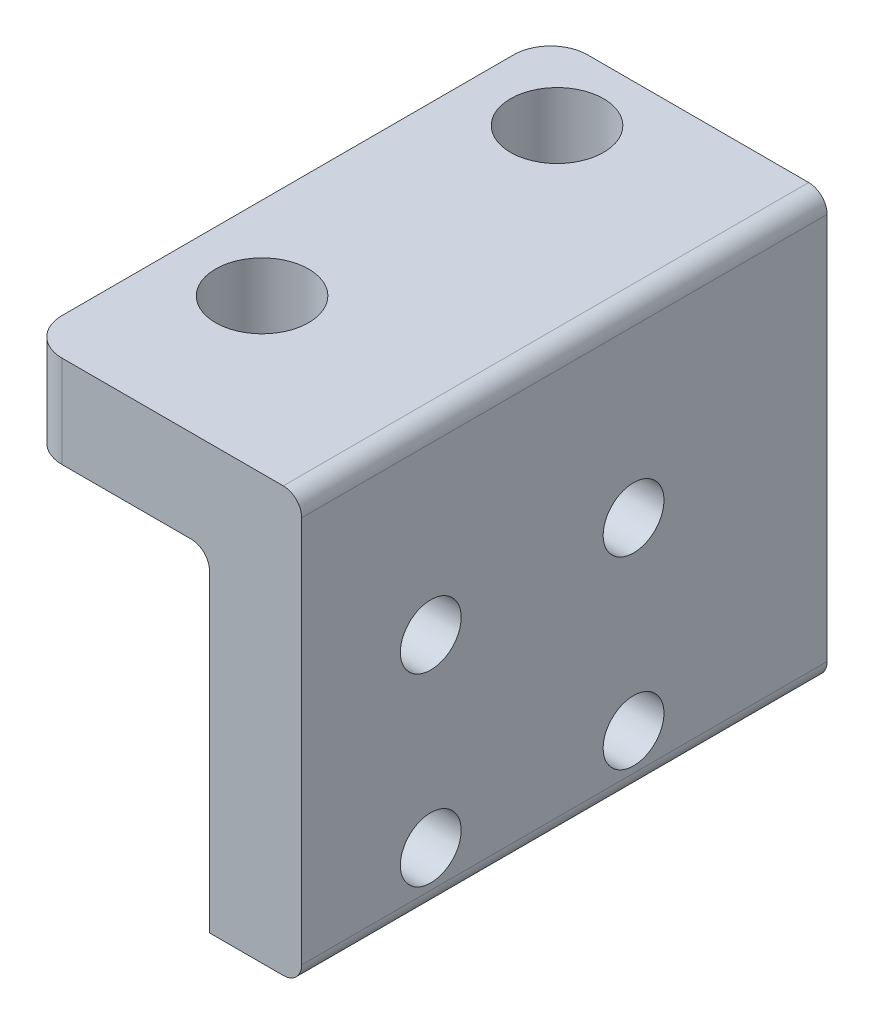
ISO-10303-21;
HEADER;
FILE_DESCRIPTION(('STEP AP214'),'2;1');
FILE_NAME('part.step','',(''),(''),'','','');
FILE_SCHEMA(('AUTOMOTIVE_DESIGN { 1 0 10303 214 1 1 1 1 }'));
ENDSEC;
DATA;
#1=APPLICATION_CONTEXT('core data for automotive mechanical design processes');
#2=APPLICATION_PROTOCOL_DEFINITION('international standard','automotive_design',2000,#1);
#3=PRODUCT_CONTEXT('',#1,'mechanical');
#4=PRODUCT('Part','Part','',(#3));
#5=PRODUCT_RELATED_PRODUCT_CATEGORY('part','',(#4));
#6=PRODUCT_DEFINITION_FORMATION('','',#4);
#7=PRODUCT_DEFINITION_CONTEXT('part definition',#1,'design');
#8=PRODUCT_DEFINITION('design','',#6,#7);
#9=PRODUCT_DEFINITION_SHAPE('','',#8);
#10=(LENGTH_UNIT() NAMED_UNIT(*) SI_UNIT(.MILLI.,.METRE.));
#11=(NAMED_UNIT(*) PLANE_ANGLE_UNIT() SI_UNIT($,.RADIAN.));
#12=(NAMED_UNIT(*) SI_UNIT($,.STERADIAN.) SOLID_ANGLE_UNIT());
#13=UNCERTAINTY_MEASURE_WITH_UNIT(LENGTH_MEASURE(1.E-05),#10,'distance_accuracy_value','');
#14=(GEOMETRIC_REPRESENTATION_CONTEXT(3) GLOBAL_UNCERTAINTY_ASSIGNED_CONTEXT((#13)) GLOBAL_UNIT_ASSIGNED_CONTEXT((#10,
#11,#12)) REPRESENTATION_CONTEXT('',''));
#15=CARTESIAN_POINT('',(0.,0.,0.));
#16=DIRECTION('',(0.,0.,1.));
#17=DIRECTION('',(1.,0.,0.));
#18=AXIS2_PLACEMENT_3D('',#15,#16,#17);
#19=CARTESIAN_POINT('',(0.,-18.,28.5));
#20=DIRECTION('',(1.,0.,0.));
#21=DIRECTION('',(0.,1.,0.));
#22=AXIS2_PLACEMENT_3D('',#19,#20,#21);
#23=PLANE('',#22);
#24=CARTESIAN_POINT('',(0.,-5.,10.5));
#25=DIRECTION('',(-1.,0.,0.));
#26=DIRECTION('',(0.,0.,1.));
#27=AXIS2_PLACEMENT_3D('',#24,#25,#26);
#28=CIRCLE('',#27,1.65);
#29=CARTESIAN_POINT('',(0.,-5.,12.15));
#30=VERTEX_POINT('',#29);
#31=EDGE_CURVE('E295',#30,#30,#28,.T.);
#32=ORIENTED_EDGE('',*,*,#31,.F.);
#33=EDGE_LOOP('',(#32));
#34=FACE_BOUND('',#33,.T.);
#35=CARTESIAN_POINT('',(0.,-15.,10.5));
#36=DIRECTION('',(-1.,0.,0.));
#37=DIRECTION('',(0.,0.,1.));
#38=AXIS2_PLACEMENT_3D('',#35,#36,#37);
#39=CIRCLE('',#38,1.65);
#40=CARTESIAN_POINT('',(0.,-15.,12.15));
#41=VERTEX_POINT('',#40);
#42=EDGE_CURVE('E289',#41,#41,#39,.T.);
#43=ORIENTED_EDGE('',*,*,#42,.F.);
#44=EDGE_LOOP('',(#43));
#45=FACE_BOUND('',#44,.T.);
#46=CARTESIAN_POINT('',(0.,-15.,21.5));
#47=DIRECTION('',(-1.,0.,0.));
#48=DIRECTION('',(0.,0.,1.));
#49=AXIS2_PLACEMENT_3D('',#46,#47,#48);
#50=CIRCLE('',#49,1.65);
#51=CARTESIAN_POINT('',(0.,-15.,23.15));
#52=VERTEX_POINT('',#51);
#53=EDGE_CURVE('E283',#52,#52,#50,.T.);
#54=ORIENTED_EDGE('',*,*,#53,.F.);
#55=EDGE_LOOP('',(#54));
#56=FACE_BOUND('',#55,.T.);
#57=CARTESIAN_POINT('',(0.,-5.,21.5));
#58=DIRECTION('',(-1.,0.,0.));
#59=DIRECTION('',(0.,0.,1.));
#60=AXIS2_PLACEMENT_3D('',#57,#58,#59);
#61=CIRCLE('',#60,1.65);
#62=CARTESIAN_POINT('',(0.,-5.,23.15));
#63=VERTEX_POINT('',#62);
#64=EDGE_CURVE('E277',#63,#63,#61,.T.);
#65=ORIENTED_EDGE('',*,*,#64,.F.);
#66=EDGE_LOOP('',(#65));
#67=FACE_BOUND('',#66,.T.);
#68=DIRECTION('',(0.,-1.,0.));
#69=VECTOR('',#68,1.);
#70=CARTESIAN_POINT('',(0.,-18.,28.5));
#71=LINE('',#70,#69);
#72=CARTESIAN_POINT('',(0.,-1.,28.5));
#73=VERTEX_POINT('',#72);
#74=CARTESIAN_POINT('',(0.,-18.,28.5));
#75=VERTEX_POINT('',#74);
#76=EDGE_CURVE('E118',#73,#75,#71,.T.);
#77=ORIENTED_EDGE('',*,*,#76,.F.);
#78=DIRECTION('',(0.,0.,-1.));
#79=VECTOR('',#78,1.);
#80=CARTESIAN_POINT('',(0.,-1.,0.));
#81=LINE('',#80,#79);
#82=CARTESIAN_POINT('',(0.,-1.,0.));
#83=VERTEX_POINT('',#82);
#84=EDGE_CURVE('E189',#73,#83,#81,.T.);
#85=ORIENTED_EDGE('',*,*,#84,.T.);
#86=DIRECTION('',(0.,-1.,0.));
#87=VECTOR('',#86,1.);
#88=CARTESIAN_POINT('',(0.,-18.,0.));
#89=LINE('',#88,#87);
#90=CARTESIAN_POINT('',(0.,-18.,0.));
#91=VERTEX_POINT('',#90);
#92=EDGE_CURVE('E139',#83,#91,#89,.T.);
#93=ORIENTED_EDGE('',*,*,#92,.T.);
#94=DIRECTION('',(0.,0.,-1.));
#95=VECTOR('',#94,1.);
#96=CARTESIAN_POINT('',(0.,-18.,28.5));
#97=LINE('',#96,#95);
#98=EDGE_CURVE('E133',#75,#91,#97,.T.);
#99=ORIENTED_EDGE('',*,*,#98,.F.);
#100=EDGE_LOOP('',(#77,#85,#93,#99));
#101=FACE_BOUND('',#100,.T.);
#102=ADVANCED_FACE('F37',(#34,#45,#56,#67,#101),#23,.F.);
#103=CARTESIAN_POINT('',(5.,-18.,28.5));
#104=DIRECTION('',(0.,1.,0.));
#105=DIRECTION('',(0.,0.,1.));
#106=AXIS2_PLACEMENT_3D('',#103,#104,#105);
#107=PLANE('',#106);
#108=DIRECTION('',(1.,0.,0.));
#109=VECTOR('',#108,1.);
#110=CARTESIAN_POINT('',(5.,-18.,0.));
#111=LINE('',#110,#109);
#112=CARTESIAN_POINT('',(4.,-18.,0.));
#113=VERTEX_POINT('',#112);
#114=EDGE_CURVE('E254',#91,#113,#111,.T.);
#115=ORIENTED_EDGE('',*,*,#114,.T.);
#116=DIRECTION('',(0.,0.,-1.));
#117=VECTOR('',#116,1.);
#118=CARTESIAN_POINT('',(4.,-18.,28.5));
#119=LINE('',#118,#117);
#120=CARTESIAN_POINT('',(4.,-18.,28.5));
#121=VERTEX_POINT('',#120);
#122=EDGE_CURVE('E135',#113,#121,#119,.F.);
#123=ORIENTED_EDGE('',*,*,#122,.T.);
#124=DIRECTION('',(1.,0.,0.));
#125=VECTOR('',#124,1.);
#126=CARTESIAN_POINT('',(5.,-18.,28.5));
#127=LINE('',#126,#125);
#128=EDGE_CURVE('E121',#75,#121,#127,.T.);
#129=ORIENTED_EDGE('',*,*,#128,.F.);
#130=ORIENTED_EDGE('',*,*,#98,.T.);
#131=EDGE_LOOP('',(#115,#123,#129,#130));
#132=FACE_BOUND('',#131,.T.);
#133=ADVANCED_FACE('F132',(#132),#107,.F.);
#134=CARTESIAN_POINT('',(5.,5.,28.5));
#135=DIRECTION('',(-1.,0.,0.));
#136=DIRECTION('',(0.,-1.,0.));
#137=AXIS2_PLACEMENT_3D('',#134,#135,#136);
#138=PLANE('',#137);
#139=CARTESIAN_POINT('',(5.,-5.,10.5));
#140=DIRECTION('',(-1.,0.,0.));
#141=DIRECTION('',(0.,0.,1.));
#142=AXIS2_PLACEMENT_3D('',#139,#140,#141);
#143=CIRCLE('',#142,1.65);
#144=CARTESIAN_POINT('',(5.,-5.,12.15));
#145=VERTEX_POINT('',#144);
#146=EDGE_CURVE('E292',#145,#145,#143,.T.);
#147=ORIENTED_EDGE('',*,*,#146,.T.);
#148=EDGE_LOOP('',(#147));
#149=FACE_BOUND('',#148,.T.);
#150=CARTESIAN_POINT('',(5.,-15.,10.5));
#151=DIRECTION('',(-1.,0.,0.));
#152=DIRECTION('',(0.,0.,1.));
#153=AXIS2_PLACEMENT_3D('',#150,#151,#152);
#154=CIRCLE('',#153,1.65);
#155=CARTESIAN_POINT('',(5.,-15.,12.15));
#156=VERTEX_POINT('',#155);
#157=EDGE_CURVE('E286',#156,#156,#154,.T.);
#158=ORIENTED_EDGE('',*,*,#157,.T.);
#159=EDGE_LOOP('',(#158));
#160=FACE_BOUND('',#159,.T.);
#161=CARTESIAN_POINT('',(5.,-15.,21.5));
#162=DIRECTION('',(-1.,0.,0.));
#163=DIRECTION('',(0.,0.,1.));
#164=AXIS2_PLACEMENT_3D('',#161,#162,#163);
#165=CIRCLE('',#164,1.65);
#166=CARTESIAN_POINT('',(5.,-15.,23.15));
#167=VERTEX_POINT('',#166);
#168=EDGE_CURVE('E280',#167,#167,#165,.T.);
#169=ORIENTED_EDGE('',*,*,#168,.T.);
#170=EDGE_LOOP('',(#169));
#171=FACE_BOUND('',#170,.T.);
#172=CARTESIAN_POINT('',(5.,-5.,21.5));
#173=DIRECTION('',(-1.,0.,0.));
#174=DIRECTION('',(0.,0.,1.));
#175=AXIS2_PLACEMENT_3D('',#172,#173,#174);
#176=CIRCLE('',#175,1.65);
#177=CARTESIAN_POINT('',(5.,-5.,23.15));
#178=VERTEX_POINT('',#177);
#179=EDGE_CURVE('E272',#178,#178,#176,.T.);
#180=ORIENTED_EDGE('',*,*,#179,.T.);
#181=EDGE_LOOP('',(#180));
#182=FACE_BOUND('',#181,.T.);
#183=DIRECTION('',(0.,1.,0.));
#184=VECTOR('',#183,1.);
#185=CARTESIAN_POINT('',(5.,5.,28.5));
#186=LINE('',#185,#184);
#187=CARTESIAN_POINT('',(5.,-17.,28.5));
#188=VERTEX_POINT('',#187);
#189=CARTESIAN_POINT('',(5.,4.,28.5));
#190=VERTEX_POINT('',#189);
#191=EDGE_CURVE('E136',#188,#190,#186,.T.);
#192=ORIENTED_EDGE('',*,*,#191,.F.);
#193=DIRECTION('',(0.,0.,-1.));
#194=VECTOR('',#193,1.);
#195=CARTESIAN_POINT('',(5.,-17.,28.5));
#196=LINE('',#195,#194);
#197=CARTESIAN_POINT('',(5.,-17.,0.));
#198=VERTEX_POINT('',#197);
#199=EDGE_CURVE('E177',#188,#198,#196,.T.);
#200=ORIENTED_EDGE('',*,*,#199,.T.);
#201=DIRECTION('',(0.,1.,0.));
#202=VECTOR('',#201,1.);
#203=CARTESIAN_POINT('',(5.,5.,0.));
#204=LINE('',#203,#202);
#205=CARTESIAN_POINT('',(5.,4.,0.));
#206=VERTEX_POINT('',#205);
#207=EDGE_CURVE('E252',#198,#206,#204,.T.);
#208=ORIENTED_EDGE('',*,*,#207,.T.);
#209=DIRECTION('',(0.,0.,-1.));
#210=VECTOR('',#209,1.);
#211=CARTESIAN_POINT('',(5.,4.,28.5));
#212=LINE('',#211,#210);
#213=EDGE_CURVE('E175',#206,#190,#212,.F.);
#214=ORIENTED_EDGE('',*,*,#213,.T.);
#215=EDGE_LOOP('',(#192,#200,#208,#214));
#216=FACE_BOUND('',#215,.T.);
#217=ADVANCED_FACE('F221',(#149,#160,#171,#182,#216),#138,.F.);
#218=CARTESIAN_POINT('',(-10.,5.,28.5));
#219=DIRECTION('',(0.,-1.,0.));
#220=DIRECTION('',(0.,0.,-1.));
#221=AXIS2_PLACEMENT_3D('',#218,#219,#220);
#222=PLANE('',#221);
#223=CARTESIAN_POINT('',(-5.5,5.,4.15));
#224=DIRECTION('',(0.,1.,0.));
#225=DIRECTION('',(-1.,0.,0.));
#226=AXIS2_PLACEMENT_3D('',#223,#224,#225);
#227=CIRCLE('',#226,2.525);
#228=CARTESIAN_POINT('',(-8.025,5.,4.15));
#229=VERTEX_POINT('',#228);
#230=EDGE_CURVE('E155',#229,#229,#227,.T.);
#231=ORIENTED_EDGE('',*,*,#230,.F.);
#232=EDGE_LOOP('',(#231));
#233=FACE_BOUND('',#232,.T.);
#234=CARTESIAN_POINT('',(-5.5,5.,20.15));
#235=DIRECTION('',(0.,1.,0.));
#236=DIRECTION('',(-1.,0.,0.));
#237=AXIS2_PLACEMENT_3D('',#234,#235,#236);
#238=CIRCLE('',#237,2.525);
#239=CARTESIAN_POINT('',(-8.025,5.,20.15));
#240=VERTEX_POINT('',#239);
#241=EDGE_CURVE('E269',#240,#240,#238,.T.);
#242=ORIENTED_EDGE('',*,*,#241,.F.);
#243=EDGE_LOOP('',(#242));
#244=FACE_BOUND('',#243,.T.);
#245=DIRECTION('',(-1.,0.,0.));
#246=VECTOR('',#245,1.);
#247=CARTESIAN_POINT('',(-10.,5.,28.5));
#248=LINE('',#247,#246);
#249=CARTESIAN_POINT('',(4.,5.,28.5));
#250=VERTEX_POINT('',#249);
#251=CARTESIAN_POINT('',(-8.,5.,28.5));
#252=VERTEX_POINT('',#251);
#253=EDGE_CURVE('E243',#250,#252,#248,.T.);
#254=ORIENTED_EDGE('',*,*,#253,.F.);
#255=DIRECTION('',(0.,0.,-1.));
#256=VECTOR('',#255,1.);
#257=CARTESIAN_POINT('',(4.,5.,28.5));
#258=LINE('',#257,#256);
#259=CARTESIAN_POINT('',(4.,5.,0.));
#260=VERTEX_POINT('',#259);
#261=EDGE_CURVE('E192',#250,#260,#258,.T.);
#262=ORIENTED_EDGE('',*,*,#261,.T.);
#263=DIRECTION('',(-1.,0.,0.));
#264=VECTOR('',#263,1.);
#265=CARTESIAN_POINT('',(-10.,5.,0.));
#266=LINE('',#265,#264);
#267=CARTESIAN_POINT('',(-8.,5.,0.));
#268=VERTEX_POINT('',#267);
#269=EDGE_CURVE('E202',#260,#268,#266,.T.);
#270=ORIENTED_EDGE('',*,*,#269,.T.);
#271=CARTESIAN_POINT('',(-8.,5.,2.));
#272=DIRECTION('',(0.,-1.,0.));
#273=DIRECTION('',(0.,0.,-1.));
#274=AXIS2_PLACEMENT_3D('',#271,#272,#273);
#275=CIRCLE('',#274,2.);
#276=CARTESIAN_POINT('',(-10.,5.,2.00000000000001));
#277=VERTEX_POINT('',#276);
#278=EDGE_CURVE('E170',#268,#277,#275,.F.);
#279=ORIENTED_EDGE('',*,*,#278,.T.);
#280=DIRECTION('',(0.,0.,-1.));
#281=VECTOR('',#280,1.);
#282=CARTESIAN_POINT('',(-10.,5.,28.5));
#283=LINE('',#282,#281);
#284=CARTESIAN_POINT('',(-10.,5.,26.5));
#285=VERTEX_POINT('',#284);
#286=EDGE_CURVE('E142',#285,#277,#283,.T.);
#287=ORIENTED_EDGE('',*,*,#286,.F.);
#288=CARTESIAN_POINT('',(-8.,5.,26.5));
#289=DIRECTION('',(0.,-1.,0.));
#290=DIRECTION('',(0.,0.,-1.));
#291=AXIS2_PLACEMENT_3D('',#288,#289,#290);
#292=CIRCLE('',#291,2.);
#293=EDGE_CURVE('E167',#285,#252,#292,.F.);
#294=ORIENTED_EDGE('',*,*,#293,.T.);
#295=EDGE_LOOP('',(#254,#262,#270,#279,#287,#294));
#296=FACE_BOUND('',#295,.T.);
#297=ADVANCED_FACE('F242',(#233,#244,#296),#222,.F.);
#298=CARTESIAN_POINT('',(-10.,0.,28.5));
#299=DIRECTION('',(1.,0.,0.));
#300=DIRECTION('',(0.,0.,-1.));
#301=AXIS2_PLACEMENT_3D('',#298,#299,#300);
#302=PLANE('',#301);
#303=ORIENTED_EDGE('',*,*,#286,.T.);
#304=DIRECTION('',(0.,-1.,0.));
#305=VECTOR('',#304,1.);
#306=CARTESIAN_POINT('',(-10.,0.,2.));
#307=LINE('',#306,#305);
#308=CARTESIAN_POINT('',(-10.,0.,2.00000000000001));
#309=VERTEX_POINT('',#308);
#310=EDGE_CURVE('E144',#277,#309,#307,.T.);
#311=ORIENTED_EDGE('',*,*,#310,.T.);
#312=DIRECTION('',(0.,0.,-1.));
#313=VECTOR('',#312,1.);
#314=CARTESIAN_POINT('',(-10.,0.,28.5));
#315=LINE('',#314,#313);
#316=CARTESIAN_POINT('',(-10.,0.,26.5));
#317=VERTEX_POINT('',#316);
#318=EDGE_CURVE('E147',#317,#309,#315,.T.);
#319=ORIENTED_EDGE('',*,*,#318,.F.);
#320=DIRECTION('',(0.,-1.,0.));
#321=VECTOR('',#320,1.);
#322=CARTESIAN_POINT('',(-10.,5.,26.5));
#323=LINE('',#322,#321);
#324=EDGE_CURVE('E141',#317,#285,#323,.F.);
#325=ORIENTED_EDGE('',*,*,#324,.T.);
#326=EDGE_LOOP('',(#303,#311,#319,#325));
#327=FACE_BOUND('',#326,.T.);
#328=ADVANCED_FACE('F248',(#327),#302,.F.);
#329=CARTESIAN_POINT('',(0.,0.,28.5));
#330=DIRECTION('',(0.,1.,0.));
#331=DIRECTION('',(-1.,0.,0.));
#332=AXIS2_PLACEMENT_3D('',#329,#330,#331);
#333=PLANE('',#332);
#334=CARTESIAN_POINT('',(-5.5,0.,4.15));
#335=DIRECTION('',(0.,1.,0.));
#336=DIRECTION('',(-1.,0.,0.));
#337=AXIS2_PLACEMENT_3D('',#334,#335,#336);
#338=CIRCLE('',#337,2.525);
#339=CARTESIAN_POINT('',(-8.025,0.,4.15));
#340=VERTEX_POINT('',#339);
#341=EDGE_CURVE('E154',#340,#340,#338,.T.);
#342=ORIENTED_EDGE('',*,*,#341,.T.);
#343=EDGE_LOOP('',(#342));
#344=FACE_BOUND('',#343,.T.);
#345=CARTESIAN_POINT('',(-5.5,0.,20.15));
#346=DIRECTION('',(0.,1.,0.));
#347=DIRECTION('',(-1.,0.,0.));
#348=AXIS2_PLACEMENT_3D('',#345,#346,#347);
#349=CIRCLE('',#348,2.525);
#350=CARTESIAN_POINT('',(-8.025,0.,20.15));
#351=VERTEX_POINT('',#350);
#352=EDGE_CURVE('E151',#351,#351,#349,.T.);
#353=ORIENTED_EDGE('',*,*,#352,.T.);
#354=EDGE_LOOP('',(#353));
#355=FACE_BOUND('',#354,.T.);
#356=DIRECTION('',(1.,0.,0.));
#357=VECTOR('',#356,1.);
#358=CARTESIAN_POINT('',(0.,0.,0.));
#359=LINE('',#358,#357);
#360=CARTESIAN_POINT('',(-8.,0.,0.));
#361=VERTEX_POINT('',#360);
#362=CARTESIAN_POINT('',(-1.,0.,0.));
#363=VERTEX_POINT('',#362);
#364=EDGE_CURVE('E127',#361,#363,#359,.T.);
#365=ORIENTED_EDGE('',*,*,#364,.T.);
#366=DIRECTION('',(0.,0.,-1.));
#367=VECTOR('',#366,1.);
#368=CARTESIAN_POINT('',(-1.,0.,28.5));
#369=LINE('',#368,#367);
#370=CARTESIAN_POINT('',(-1.,0.,28.5));
#371=VERTEX_POINT('',#370);
#372=EDGE_CURVE('E58',#363,#371,#369,.F.);
#373=ORIENTED_EDGE('',*,*,#372,.T.);
#374=DIRECTION('',(1.,0.,0.));
#375=VECTOR('',#374,1.);
#376=CARTESIAN_POINT('',(0.,0.,28.5));
#377=LINE('',#376,#375);
#378=CARTESIAN_POINT('',(-8.,0.,28.5));
#379=VERTEX_POINT('',#378);
#380=EDGE_CURVE('E257',#379,#371,#377,.T.);
#381=ORIENTED_EDGE('',*,*,#380,.F.);
#382=CARTESIAN_POINT('',(-8.,0.,26.5));
#383=DIRECTION('',(0.,1.,0.));
#384=DIRECTION('',(-1.,0.,0.));
#385=AXIS2_PLACEMENT_3D('',#382,#383,#384);
#386=CIRCLE('',#385,2.);
#387=EDGE_CURVE('E160',#379,#317,#386,.F.);
#388=ORIENTED_EDGE('',*,*,#387,.T.);
#389=ORIENTED_EDGE('',*,*,#318,.T.);
#390=CARTESIAN_POINT('',(-8.,0.,2.));
#391=DIRECTION('',(0.,1.,0.));
#392=DIRECTION('',(-1.,0.,0.));
#393=AXIS2_PLACEMENT_3D('',#390,#391,#392);
#394=CIRCLE('',#393,2.);
#395=EDGE_CURVE('E162',#309,#361,#394,.F.);
#396=ORIENTED_EDGE('',*,*,#395,.T.);
#397=EDGE_LOOP('',(#365,#373,#381,#388,#389,#396));
#398=FACE_BOUND('',#397,.T.);
#399=ADVANCED_FACE('F200',(#344,#355,#398),#333,.F.);
#400=CARTESIAN_POINT('',(0.,0.,28.5));
#401=DIRECTION('',(0.,0.,1.));
#402=DIRECTION('',(1.,0.,0.));
#403=AXIS2_PLACEMENT_3D('',#400,#401,#402);
#404=PLANE('',#403);
#405=ORIENTED_EDGE('',*,*,#128,.T.);
#406=CARTESIAN_POINT('',(4.,-17.,28.5));
#407=DIRECTION('',(0.,0.,1.));
#408=DIRECTION('',(1.,0.,0.));
#409=AXIS2_PLACEMENT_3D('',#406,#407,#408);
#410=CIRCLE('',#409,1.);
#411=EDGE_CURVE('E187',#121,#188,#410,.T.);
#412=ORIENTED_EDGE('',*,*,#411,.T.);
#413=ORIENTED_EDGE('',*,*,#191,.T.);
#414=CARTESIAN_POINT('',(4.,4.,28.5));
#415=DIRECTION('',(0.,0.,1.));
#416=DIRECTION('',(1.,0.,0.));
#417=AXIS2_PLACEMENT_3D('',#414,#415,#416);
#418=CIRCLE('',#417,1.);
#419=EDGE_CURVE('E185',#190,#250,#418,.T.);
#420=ORIENTED_EDGE('',*,*,#419,.T.);
#421=ORIENTED_EDGE('',*,*,#253,.T.);
#422=DIRECTION('',(0.,-1.,0.));
#423=VECTOR('',#422,1.);
#424=CARTESIAN_POINT('',(-8.,0.,28.5));
#425=LINE('',#424,#423);
#426=EDGE_CURVE('E172',#252,#379,#425,.T.);
#427=ORIENTED_EDGE('',*,*,#426,.T.);
#428=ORIENTED_EDGE('',*,*,#380,.T.);
#429=CARTESIAN_POINT('',(-1.,-1.,28.5));
#430=DIRECTION('',(0.,0.,1.));
#431=DIRECTION('',(1.,0.,0.));
#432=AXIS2_PLACEMENT_3D('',#429,#430,#431);
#433=CIRCLE('',#432,1.);
#434=EDGE_CURVE('E11',#371,#73,#433,.F.);
#435=ORIENTED_EDGE('',*,*,#434,.T.);
#436=ORIENTED_EDGE('',*,*,#76,.T.);
#437=EDGE_LOOP('',(#405,#412,#413,#420,#421,#427,#428,#435,#436));
#438=FACE_BOUND('',#437,.T.);
#439=ADVANCED_FACE('F120',(#438),#404,.T.);
#440=CARTESIAN_POINT('',(0.,0.,0.));
#441=DIRECTION('',(0.,0.,1.));
#442=DIRECTION('',(1.,0.,0.));
#443=AXIS2_PLACEMENT_3D('',#440,#441,#442);
#444=PLANE('',#443);
#445=ORIENTED_EDGE('',*,*,#207,.F.);
#446=CARTESIAN_POINT('',(4.,-17.,0.));
#447=DIRECTION('',(0.,0.,1.));
#448=DIRECTION('',(1.,0.,0.));
#449=AXIS2_PLACEMENT_3D('',#446,#447,#448);
#450=CIRCLE('',#449,1.);
#451=EDGE_CURVE('E182',#198,#113,#450,.F.);
#452=ORIENTED_EDGE('',*,*,#451,.T.);
#453=ORIENTED_EDGE('',*,*,#114,.F.);
#454=ORIENTED_EDGE('',*,*,#92,.F.);
#455=CARTESIAN_POINT('',(-1.,-1.,0.));
#456=DIRECTION('',(0.,0.,1.));
#457=DIRECTION('',(1.,0.,0.));
#458=AXIS2_PLACEMENT_3D('',#455,#456,#457);
#459=CIRCLE('',#458,1.);
#460=EDGE_CURVE('E45',#83,#363,#459,.T.);
#461=ORIENTED_EDGE('',*,*,#460,.T.);
#462=ORIENTED_EDGE('',*,*,#364,.F.);
#463=DIRECTION('',(0.,-1.,0.));
#464=VECTOR('',#463,1.);
#465=CARTESIAN_POINT('',(-8.,0.,0.));
#466=LINE('',#465,#464);
#467=EDGE_CURVE('E164',#361,#268,#466,.F.);
#468=ORIENTED_EDGE('',*,*,#467,.T.);
#469=ORIENTED_EDGE('',*,*,#269,.F.);
#470=CARTESIAN_POINT('',(4.,4.,0.));
#471=DIRECTION('',(0.,0.,1.));
#472=DIRECTION('',(1.,0.,0.));
#473=AXIS2_PLACEMENT_3D('',#470,#471,#472);
#474=CIRCLE('',#473,1.);
#475=EDGE_CURVE('E180',#260,#206,#474,.F.);
#476=ORIENTED_EDGE('',*,*,#475,.T.);
#477=EDGE_LOOP('',(#445,#452,#453,#454,#461,#462,#468,#469,#476));
#478=FACE_BOUND('',#477,.T.);
#479=ADVANCED_FACE('F197',(#478),#444,.F.);
#480=CARTESIAN_POINT('',(-5.50000000000001,-23.5,20.15));
#481=DIRECTION('',(0.,1.,0.));
#482=DIRECTION('',(-1.,0.,0.));
#483=AXIS2_PLACEMENT_3D('',#480,#481,#482);
#484=CYLINDRICAL_SURFACE('',#483,2.525);
#485=ORIENTED_EDGE('',*,*,#241,.T.);
#486=EDGE_LOOP('',(#485));
#487=FACE_BOUND('',#486,.T.);
#488=ORIENTED_EDGE('',*,*,#352,.F.);
#489=EDGE_LOOP('',(#488));
#490=FACE_BOUND('',#489,.T.);
#491=ADVANCED_FACE('F320',(#487,#490),#484,.F.);
#492=CARTESIAN_POINT('',(-5.50000000000001,-23.5,4.15));
#493=DIRECTION('',(0.,1.,0.));
#494=DIRECTION('',(-1.,0.,0.));
#495=AXIS2_PLACEMENT_3D('',#492,#493,#494);
#496=CYLINDRICAL_SURFACE('',#495,2.525);
#497=ORIENTED_EDGE('',*,*,#230,.T.);
#498=EDGE_LOOP('',(#497));
#499=FACE_BOUND('',#498,.T.);
#500=ORIENTED_EDGE('',*,*,#341,.F.);
#501=EDGE_LOOP('',(#500));
#502=FACE_BOUND('',#501,.T.);
#503=ADVANCED_FACE('F316',(#499,#502),#496,.F.);
#504=CARTESIAN_POINT('',(0.,-5.,21.5));
#505=DIRECTION('',(-1.,0.,0.));
#506=DIRECTION('',(0.,0.,1.));
#507=AXIS2_PLACEMENT_3D('',#504,#505,#506);
#508=CYLINDRICAL_SURFACE('',#507,1.65);
#509=ORIENTED_EDGE('',*,*,#179,.F.);
#510=EDGE_LOOP('',(#509));
#511=FACE_BOUND('',#510,.T.);
#512=ORIENTED_EDGE('',*,*,#64,.T.);
#513=EDGE_LOOP('',(#512));
#514=FACE_BOUND('',#513,.T.);
#515=ADVANCED_FACE('F312',(#511,#514),#508,.F.);
#516=CARTESIAN_POINT('',(0.,-15.,21.5));
#517=DIRECTION('',(-1.,0.,0.));
#518=DIRECTION('',(0.,0.,1.));
#519=AXIS2_PLACEMENT_3D('',#516,#517,#518);
#520=CYLINDRICAL_SURFACE('',#519,1.65);
#521=ORIENTED_EDGE('',*,*,#168,.F.);
#522=EDGE_LOOP('',(#521));
#523=FACE_BOUND('',#522,.T.);
#524=ORIENTED_EDGE('',*,*,#53,.T.);
#525=EDGE_LOOP('',(#524));
#526=FACE_BOUND('',#525,.T.);
#527=ADVANCED_FACE('F305',(#523,#526),#520,.F.);
#528=CARTESIAN_POINT('',(0.,-15.,10.5));
#529=DIRECTION('',(-1.,0.,0.));
#530=DIRECTION('',(0.,0.,1.));
#531=AXIS2_PLACEMENT_3D('',#528,#529,#530);
#532=CYLINDRICAL_SURFACE('',#531,1.65);
#533=ORIENTED_EDGE('',*,*,#157,.F.);
#534=EDGE_LOOP('',(#533));
#535=FACE_BOUND('',#534,.T.);
#536=ORIENTED_EDGE('',*,*,#42,.T.);
#537=EDGE_LOOP('',(#536));
#538=FACE_BOUND('',#537,.T.);
#539=ADVANCED_FACE('F299',(#535,#538),#532,.F.);
#540=CARTESIAN_POINT('',(0.,-5.,10.5));
#541=DIRECTION('',(-1.,0.,0.));
#542=DIRECTION('',(0.,0.,1.));
#543=AXIS2_PLACEMENT_3D('',#540,#541,#542);
#544=CYLINDRICAL_SURFACE('',#543,1.65);
#545=ORIENTED_EDGE('',*,*,#146,.F.);
#546=EDGE_LOOP('',(#545));
#547=FACE_BOUND('',#546,.T.);
#548=ORIENTED_EDGE('',*,*,#31,.T.);
#549=EDGE_LOOP('',(#548));
#550=FACE_BOUND('',#549,.T.);
#551=ADVANCED_FACE('F230',(#547,#550),#544,.F.);
#552=CARTESIAN_POINT('',(-8.,0.,2.));
#553=DIRECTION('',(0.,-1.,0.));
#554=DIRECTION('',(0.,0.,-1.));
#555=AXIS2_PLACEMENT_3D('',#552,#553,#554);
#556=CYLINDRICAL_SURFACE('',#555,2.);
#557=ORIENTED_EDGE('',*,*,#278,.F.);
#558=ORIENTED_EDGE('',*,*,#467,.F.);
#559=ORIENTED_EDGE('',*,*,#395,.F.);
#560=ORIENTED_EDGE('',*,*,#310,.F.);
#561=EDGE_LOOP('',(#557,#558,#559,#560));
#562=FACE_BOUND('',#561,.T.);
#563=ADVANCED_FACE('F227',(#562),#556,.T.);
#564=CARTESIAN_POINT('',(-8.,0.,26.5));
#565=DIRECTION('',(0.,1.,0.));
#566=DIRECTION('',(0.,0.,1.));
#567=AXIS2_PLACEMENT_3D('',#564,#565,#566);
#568=CYLINDRICAL_SURFACE('',#567,2.);
#569=ORIENTED_EDGE('',*,*,#293,.F.);
#570=ORIENTED_EDGE('',*,*,#324,.F.);
#571=ORIENTED_EDGE('',*,*,#387,.F.);
#572=ORIENTED_EDGE('',*,*,#426,.F.);
#573=EDGE_LOOP('',(#569,#570,#571,#572));
#574=FACE_BOUND('',#573,.T.);
#575=ADVANCED_FACE('F212',(#574),#568,.T.);
#576=CARTESIAN_POINT('',(4.,-17.,28.5));
#577=DIRECTION('',(0.,0.,-1.));
#578=DIRECTION('',(-1.,0.,0.));
#579=AXIS2_PLACEMENT_3D('',#576,#577,#578);
#580=CYLINDRICAL_SURFACE('',#579,1.);
#581=ORIENTED_EDGE('',*,*,#411,.F.);
#582=ORIENTED_EDGE('',*,*,#122,.F.);
#583=ORIENTED_EDGE('',*,*,#451,.F.);
#584=ORIENTED_EDGE('',*,*,#199,.F.);
#585=EDGE_LOOP('',(#581,#582,#583,#584));
#586=FACE_BOUND('',#585,.T.);
#587=ADVANCED_FACE('F206',(#586),#580,.T.);
#588=CARTESIAN_POINT('',(-1.,-1.,28.5));
#589=DIRECTION('',(0.,0.,1.));
#590=DIRECTION('',(1.,0.,0.));
#591=AXIS2_PLACEMENT_3D('',#588,#589,#590);
#592=CYLINDRICAL_SURFACE('',#591,1.);
#593=ORIENTED_EDGE('',*,*,#434,.F.);
#594=ORIENTED_EDGE('',*,*,#372,.F.);
#595=ORIENTED_EDGE('',*,*,#460,.F.);
#596=ORIENTED_EDGE('',*,*,#84,.F.);
#597=EDGE_LOOP('',(#593,#594,#595,#596));
#598=FACE_BOUND('',#597,.T.);
#599=ADVANCED_FACE('F204',(#598),#592,.F.);
#600=CARTESIAN_POINT('',(4.,4.,28.5));
#601=DIRECTION('',(0.,0.,-1.));
#602=DIRECTION('',(-1.,0.,0.));
#603=AXIS2_PLACEMENT_3D('',#600,#601,#602);
#604=CYLINDRICAL_SURFACE('',#603,1.);
#605=ORIENTED_EDGE('',*,*,#419,.F.);
#606=ORIENTED_EDGE('',*,*,#213,.F.);
#607=ORIENTED_EDGE('',*,*,#475,.F.);
#608=ORIENTED_EDGE('',*,*,#261,.F.);
#609=EDGE_LOOP('',(#605,#606,#607,#608));
#610=FACE_BOUND('',#609,.T.);
#611=ADVANCED_FACE('F39',(#610),#604,.T.);
#612=CLOSED_SHELL('',(#102,#133,#217,#297,#328,#399,#439,#479,#491,#503,#515,#527,#539,#551,
#563,#575,#587,#599,#611));
#613=MANIFOLD_SOLID_BREP('B2',#612);
#614=ADVANCED_BREP_SHAPE_REPRESENTATION('',(#18,#613),#14);
#615=SHAPE_DEFINITION_REPRESENTATION(#9,#614);
ENDSEC;
END-ISO-10303-21;
